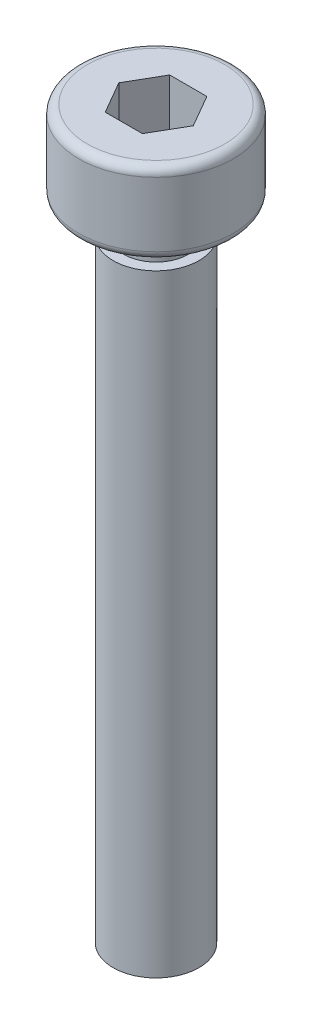
ISO-10303-21;
HEADER;
FILE_DESCRIPTION(('STEP AP214'),'2;1');
FILE_NAME('part.step','',(''),(''),'','','');
FILE_SCHEMA(('AUTOMOTIVE_DESIGN { 1 0 10303 214 1 1 1 1 }'));
ENDSEC;
DATA;
#1=APPLICATION_CONTEXT('core data for automotive mechanical design processes');
#2=APPLICATION_PROTOCOL_DEFINITION('international standard','automotive_design',2000,#1);
#3=PRODUCT_CONTEXT('',#1,'mechanical');
#4=PRODUCT('Part','Part','',(#3));
#5=PRODUCT_RELATED_PRODUCT_CATEGORY('part','',(#4));
#6=PRODUCT_DEFINITION_FORMATION('','',#4);
#7=PRODUCT_DEFINITION_CONTEXT('part definition',#1,'design');
#8=PRODUCT_DEFINITION('design','',#6,#7);
#9=PRODUCT_DEFINITION_SHAPE('','',#8);
#10=(LENGTH_UNIT() NAMED_UNIT(*) SI_UNIT(.MILLI.,.METRE.));
#11=(NAMED_UNIT(*) PLANE_ANGLE_UNIT() SI_UNIT($,.RADIAN.));
#12=(NAMED_UNIT(*) SI_UNIT($,.STERADIAN.) SOLID_ANGLE_UNIT());
#13=UNCERTAINTY_MEASURE_WITH_UNIT(LENGTH_MEASURE(1.E-05),#10,'distance_accuracy_value','');
#14=(GEOMETRIC_REPRESENTATION_CONTEXT(3) GLOBAL_UNCERTAINTY_ASSIGNED_CONTEXT((#13)) GLOBAL_UNIT_ASSIGNED_CONTEXT((#10,
#11,#12)) REPRESENTATION_CONTEXT('',''));
#15=CARTESIAN_POINT('',(0.,0.,0.));
#16=DIRECTION('',(0.,0.,1.));
#17=DIRECTION('',(1.,0.,0.));
#18=AXIS2_PLACEMENT_3D('',#15,#16,#17);
#19=CARTESIAN_POINT('',(0.,33.8,0.));
#20=DIRECTION('',(0.,-1.,0.));
#21=DIRECTION('',(0.,0.,-1.));
#22=AXIS2_PLACEMENT_3D('',#19,#20,#21);
#23=PLANE('',#22);
#24=DIRECTION('',(-0.5,0.,0.866025403784439));
#25=VECTOR('',#24,1.);
#26=CARTESIAN_POINT('',(-0.866025403784439,33.8,-1.5));
#27=LINE('',#26,#25);
#28=CARTESIAN_POINT('',(-0.866025403784439,33.8,-1.5));
#29=VERTEX_POINT('',#28);
#30=CARTESIAN_POINT('',(-1.73205080756888,33.8,0.));
#31=VERTEX_POINT('',#30);
#32=EDGE_CURVE('E124',#29,#31,#27,.T.);
#33=ORIENTED_EDGE('',*,*,#32,.F.);
#34=DIRECTION('',(-1.,0.,0.));
#35=VECTOR('',#34,1.);
#36=CARTESIAN_POINT('',(0.86602540378444,33.8,-1.5));
#37=LINE('',#36,#35);
#38=CARTESIAN_POINT('',(0.86602540378444,33.8,-1.5));
#39=VERTEX_POINT('',#38);
#40=EDGE_CURVE('E50',#39,#29,#37,.T.);
#41=ORIENTED_EDGE('',*,*,#40,.F.);
#42=DIRECTION('',(-0.5,0.,-0.866025403784439));
#43=VECTOR('',#42,1.);
#44=CARTESIAN_POINT('',(1.73205080756888,33.8,0.));
#45=LINE('',#44,#43);
#46=CARTESIAN_POINT('',(1.73205080756888,33.8,0.));
#47=VERTEX_POINT('',#46);
#48=EDGE_CURVE('E133',#47,#39,#45,.T.);
#49=ORIENTED_EDGE('',*,*,#48,.F.);
#50=DIRECTION('',(0.5,0.,-0.866025403784439));
#51=VECTOR('',#50,1.);
#52=CARTESIAN_POINT('',(0.866025403784438,33.8,1.5));
#53=LINE('',#52,#51);
#54=CARTESIAN_POINT('',(0.866025403784438,33.8,1.5));
#55=VERTEX_POINT('',#54);
#56=EDGE_CURVE('E131',#55,#47,#53,.T.);
#57=ORIENTED_EDGE('',*,*,#56,.F.);
#58=DIRECTION('',(1.,0.,0.));
#59=VECTOR('',#58,1.);
#60=CARTESIAN_POINT('',(-0.86602540378444,33.8,1.5));
#61=LINE('',#60,#59);
#62=CARTESIAN_POINT('',(-0.86602540378444,33.8,1.5));
#63=VERTEX_POINT('',#62);
#64=EDGE_CURVE('E98',#63,#55,#61,.T.);
#65=ORIENTED_EDGE('',*,*,#64,.F.);
#66=DIRECTION('',(0.5,0.,0.866025403784439));
#67=VECTOR('',#66,1.);
#68=CARTESIAN_POINT('',(-1.73205080756888,33.8,0.));
#69=LINE('',#68,#67);
#70=EDGE_CURVE('E127',#31,#63,#69,.T.);
#71=ORIENTED_EDGE('',*,*,#70,.F.);
#72=EDGE_LOOP('',(#33,#41,#49,#57,#65,#71));
#73=FACE_BOUND('',#72,.T.);
#74=CARTESIAN_POINT('',(0.,33.8,0.));
#75=DIRECTION('',(0.,-1.,0.));
#76=DIRECTION('',(0.,0.,-1.));
#77=AXIS2_PLACEMENT_3D('',#74,#75,#76);
#78=CIRCLE('',#77,3.2);
#79=CARTESIAN_POINT('',(0.,33.8,-3.2));
#80=VERTEX_POINT('',#79);
#81=EDGE_CURVE('E11',#80,#80,#78,.T.);
#82=ORIENTED_EDGE('',*,*,#81,.F.);
#83=EDGE_LOOP('',(#82));
#84=FACE_BOUND('',#83,.T.);
#85=ADVANCED_FACE('F36',(#73,#84),#23,.F.);
#86=CARTESIAN_POINT('',(0.,33.4,0.));
#87=DIRECTION('',(0.,-1.,0.));
#88=DIRECTION('',(0.,0.,-1.));
#89=AXIS2_PLACEMENT_3D('',#86,#87,#88);
#90=TOROIDAL_SURFACE('',#89,3.2,0.399999999999999);
#91=CARTESIAN_POINT('',(0.,33.4,0.));
#92=DIRECTION('',(0.,-1.,0.));
#93=DIRECTION('',(0.,0.,-1.));
#94=AXIS2_PLACEMENT_3D('',#91,#92,#93);
#95=CIRCLE('',#94,3.6);
#96=CARTESIAN_POINT('',(0.,33.4,-3.6));
#97=VERTEX_POINT('',#96);
#98=EDGE_CURVE('E43',#97,#97,#95,.T.);
#99=ORIENTED_EDGE('',*,*,#98,.F.);
#100=EDGE_LOOP('',(#99));
#101=FACE_BOUND('',#100,.T.);
#102=ORIENTED_EDGE('',*,*,#81,.T.);
#103=EDGE_LOOP('',(#102));
#104=FACE_BOUND('',#103,.T.);
#105=ADVANCED_FACE('F164',(#101,#104),#90,.T.);
#106=CARTESIAN_POINT('',(0.,0.,0.));
#107=DIRECTION('',(0.,-1.,0.));
#108=DIRECTION('',(0.,0.,-1.));
#109=AXIS2_PLACEMENT_3D('',#106,#107,#108);
#110=CYLINDRICAL_SURFACE('',#109,3.6);
#111=CARTESIAN_POINT('',(0.,30.4,0.));
#112=DIRECTION('',(0.,-1.,0.));
#113=DIRECTION('',(0.,0.,-1.));
#114=AXIS2_PLACEMENT_3D('',#111,#112,#113);
#115=CIRCLE('',#114,3.60000000000001);
#116=CARTESIAN_POINT('',(0.,30.4,-3.60000000000001));
#117=VERTEX_POINT('',#116);
#118=EDGE_CURVE('E157',#117,#117,#115,.T.);
#119=ORIENTED_EDGE('',*,*,#118,.F.);
#120=EDGE_LOOP('',(#119));
#121=FACE_BOUND('',#120,.T.);
#122=ORIENTED_EDGE('',*,*,#98,.T.);
#123=EDGE_LOOP('',(#122));
#124=FACE_BOUND('',#123,.T.);
#125=ADVANCED_FACE('F162',(#121,#124),#110,.T.);
#126=CARTESIAN_POINT('',(0.,30.4,0.));
#127=DIRECTION('',(0.,-1.,0.));
#128=DIRECTION('',(0.,0.,-1.));
#129=AXIS2_PLACEMENT_3D('',#126,#127,#128);
#130=TOROIDAL_SURFACE('',#129,3.2,0.400000000000004);
#131=CARTESIAN_POINT('',(0.,30.,0.));
#132=DIRECTION('',(0.,-1.,0.));
#133=DIRECTION('',(0.,0.,-1.));
#134=AXIS2_PLACEMENT_3D('',#131,#132,#133);
#135=CIRCLE('',#134,3.2);
#136=CARTESIAN_POINT('',(0.,30.,-3.2));
#137=VERTEX_POINT('',#136);
#138=EDGE_CURVE('E154',#137,#137,#135,.T.);
#139=ORIENTED_EDGE('',*,*,#138,.F.);
#140=EDGE_LOOP('',(#139));
#141=FACE_BOUND('',#140,.T.);
#142=ORIENTED_EDGE('',*,*,#118,.T.);
#143=EDGE_LOOP('',(#142));
#144=FACE_BOUND('',#143,.T.);
#145=ADVANCED_FACE('F209',(#141,#144),#130,.T.);
#146=CARTESIAN_POINT('',(-3.2,30.,0.));
#147=DIRECTION('',(0.,1.,0.));
#148=DIRECTION('',(0.,0.,1.));
#149=AXIS2_PLACEMENT_3D('',#146,#147,#148);
#150=PLANE('',#149);
#151=CARTESIAN_POINT('',(0.,30.,0.));
#152=DIRECTION('',(0.,-1.,0.));
#153=DIRECTION('',(0.,0.,-1.));
#154=AXIS2_PLACEMENT_3D('',#151,#152,#153);
#155=CIRCLE('',#154,1.5);
#156=CARTESIAN_POINT('',(0.,30.,-1.5));
#157=VERTEX_POINT('',#156);
#158=EDGE_CURVE('E151',#157,#157,#155,.T.);
#159=ORIENTED_EDGE('',*,*,#158,.F.);
#160=EDGE_LOOP('',(#159));
#161=FACE_BOUND('',#160,.T.);
#162=ORIENTED_EDGE('',*,*,#138,.T.);
#163=EDGE_LOOP('',(#162));
#164=FACE_BOUND('',#163,.T.);
#165=ADVANCED_FACE('F205',(#161,#164),#150,.F.);
#166=CARTESIAN_POINT('',(0.,0.,0.));
#167=DIRECTION('',(0.,-1.,0.));
#168=DIRECTION('',(0.,0.,-1.));
#169=AXIS2_PLACEMENT_3D('',#166,#167,#168);
#170=CYLINDRICAL_SURFACE('',#169,1.5);
#171=CARTESIAN_POINT('',(0.,28.5,0.));
#172=DIRECTION('',(0.,-1.,0.));
#173=DIRECTION('',(0.,0.,-1.));
#174=AXIS2_PLACEMENT_3D('',#171,#172,#173);
#175=CIRCLE('',#174,1.5);
#176=CARTESIAN_POINT('',(0.,28.5,-1.5));
#177=VERTEX_POINT('',#176);
#178=EDGE_CURVE('E148',#177,#177,#175,.T.);
#179=ORIENTED_EDGE('',*,*,#178,.F.);
#180=EDGE_LOOP('',(#179));
#181=FACE_BOUND('',#180,.T.);
#182=ORIENTED_EDGE('',*,*,#158,.T.);
#183=EDGE_LOOP('',(#182));
#184=FACE_BOUND('',#183,.T.);
#185=ADVANCED_FACE('F201',(#181,#184),#170,.T.);
#186=CARTESIAN_POINT('',(-1.5,28.5,0.));
#187=DIRECTION('',(0.,-1.,0.));
#188=DIRECTION('',(0.,0.,-1.));
#189=AXIS2_PLACEMENT_3D('',#186,#187,#188);
#190=PLANE('',#189);
#191=CARTESIAN_POINT('',(0.,28.5,0.));
#192=DIRECTION('',(0.,-1.,0.));
#193=DIRECTION('',(0.,0.,-1.));
#194=AXIS2_PLACEMENT_3D('',#191,#192,#193);
#195=CIRCLE('',#194,2.);
#196=CARTESIAN_POINT('',(0.,28.5,-2.));
#197=VERTEX_POINT('',#196);
#198=EDGE_CURVE('E145',#197,#197,#195,.T.);
#199=ORIENTED_EDGE('',*,*,#198,.F.);
#200=EDGE_LOOP('',(#199));
#201=FACE_BOUND('',#200,.T.);
#202=ORIENTED_EDGE('',*,*,#178,.T.);
#203=EDGE_LOOP('',(#202));
#204=FACE_BOUND('',#203,.T.);
#205=ADVANCED_FACE('F197',(#201,#204),#190,.F.);
#206=CARTESIAN_POINT('',(0.,0.,0.));
#207=DIRECTION('',(0.,-1.,0.));
#208=DIRECTION('',(0.,0.,-1.));
#209=AXIS2_PLACEMENT_3D('',#206,#207,#208);
#210=CYLINDRICAL_SURFACE('',#209,2.);
#211=CARTESIAN_POINT('',(0.,0.,0.));
#212=DIRECTION('',(0.,-1.,0.));
#213=DIRECTION('',(0.,0.,-1.));
#214=AXIS2_PLACEMENT_3D('',#211,#212,#213);
#215=CIRCLE('',#214,2.);
#216=CARTESIAN_POINT('',(0.,0.,-2.));
#217=VERTEX_POINT('',#216);
#218=EDGE_CURVE('E137',#217,#217,#215,.T.);
#219=ORIENTED_EDGE('',*,*,#218,.F.);
#220=EDGE_LOOP('',(#219));
#221=FACE_BOUND('',#220,.T.);
#222=ORIENTED_EDGE('',*,*,#198,.T.);
#223=EDGE_LOOP('',(#222));
#224=FACE_BOUND('',#223,.T.);
#225=ADVANCED_FACE('F189',(#221,#224),#210,.T.);
#226=CARTESIAN_POINT('',(-2.,0.,0.));
#227=DIRECTION('',(0.,1.,0.));
#228=DIRECTION('',(0.,0.,1.));
#229=AXIS2_PLACEMENT_3D('',#226,#227,#228);
#230=PLANE('',#229);
#231=ORIENTED_EDGE('',*,*,#218,.T.);
#232=EDGE_LOOP('',(#231));
#233=FACE_BOUND('',#232,.T.);
#234=ADVANCED_FACE('F182',(#233),#230,.F.);
#235=CARTESIAN_POINT('',(0.86602540378444,31.,-1.5));
#236=DIRECTION('',(0.,0.,-1.));
#237=DIRECTION('',(-1.,0.,0.));
#238=AXIS2_PLACEMENT_3D('',#235,#236,#237);
#239=PLANE('',#238);
#240=ORIENTED_EDGE('',*,*,#40,.T.);
#241=DIRECTION('',(0.,1.,0.));
#242=VECTOR('',#241,1.);
#243=CARTESIAN_POINT('',(-0.866025403784439,31.,-1.5));
#244=LINE('',#243,#242);
#245=CARTESIAN_POINT('',(-0.866025403784439,31.,-1.5));
#246=VERTEX_POINT('',#245);
#247=EDGE_CURVE('E80',#246,#29,#244,.T.);
#248=ORIENTED_EDGE('',*,*,#247,.F.);
#249=DIRECTION('',(-1.,0.,0.));
#250=VECTOR('',#249,1.);
#251=CARTESIAN_POINT('',(0.86602540378444,31.,-1.5));
#252=LINE('',#251,#250);
#253=CARTESIAN_POINT('',(0.86602540378444,31.,-1.5));
#254=VERTEX_POINT('',#253);
#255=EDGE_CURVE('E135',#254,#246,#252,.T.);
#256=ORIENTED_EDGE('',*,*,#255,.F.);
#257=DIRECTION('',(0.,1.,0.));
#258=VECTOR('',#257,1.);
#259=CARTESIAN_POINT('',(0.86602540378444,31.,-1.5));
#260=LINE('',#259,#258);
#261=EDGE_CURVE('E58',#254,#39,#260,.T.);
#262=ORIENTED_EDGE('',*,*,#261,.T.);
#263=EDGE_LOOP('',(#240,#248,#256,#262));
#264=FACE_BOUND('',#263,.T.);
#265=ADVANCED_FACE('F179',(#264),#239,.F.);
#266=CARTESIAN_POINT('',(1.73205080756888,31.,0.));
#267=DIRECTION('',(0.866025403784439,0.,-0.5));
#268=DIRECTION('',(-0.5,0.,-0.866025403784439));
#269=AXIS2_PLACEMENT_3D('',#266,#267,#268);
#270=PLANE('',#269);
#271=ORIENTED_EDGE('',*,*,#48,.T.);
#272=ORIENTED_EDGE('',*,*,#261,.F.);
#273=DIRECTION('',(-0.5,0.,-0.866025403784439));
#274=VECTOR('',#273,1.);
#275=CARTESIAN_POINT('',(1.73205080756888,31.,0.));
#276=LINE('',#275,#274);
#277=CARTESIAN_POINT('',(1.73205080756888,31.,0.));
#278=VERTEX_POINT('',#277);
#279=EDGE_CURVE('E110',#278,#254,#276,.T.);
#280=ORIENTED_EDGE('',*,*,#279,.F.);
#281=DIRECTION('',(0.,1.,0.));
#282=VECTOR('',#281,1.);
#283=CARTESIAN_POINT('',(1.73205080756888,31.,0.));
#284=LINE('',#283,#282);
#285=EDGE_CURVE('E102',#278,#47,#284,.T.);
#286=ORIENTED_EDGE('',*,*,#285,.T.);
#287=EDGE_LOOP('',(#271,#272,#280,#286));
#288=FACE_BOUND('',#287,.T.);
#289=ADVANCED_FACE('F181',(#288),#270,.F.);
#290=CARTESIAN_POINT('',(0.866025403784438,31.,1.5));
#291=DIRECTION('',(0.866025403784439,0.,0.5));
#292=DIRECTION('',(0.5,0.,-0.866025403784438));
#293=AXIS2_PLACEMENT_3D('',#290,#291,#292);
#294=PLANE('',#293);
#295=ORIENTED_EDGE('',*,*,#56,.T.);
#296=ORIENTED_EDGE('',*,*,#285,.F.);
#297=DIRECTION('',(0.5,0.,-0.866025403784439));
#298=VECTOR('',#297,1.);
#299=CARTESIAN_POINT('',(0.866025403784438,31.,1.5));
#300=LINE('',#299,#298);
#301=CARTESIAN_POINT('',(0.866025403784438,31.,1.5));
#302=VERTEX_POINT('',#301);
#303=EDGE_CURVE('E106',#302,#278,#300,.T.);
#304=ORIENTED_EDGE('',*,*,#303,.F.);
#305=DIRECTION('',(0.,1.,0.));
#306=VECTOR('',#305,1.);
#307=CARTESIAN_POINT('',(0.866025403784438,31.,1.5));
#308=LINE('',#307,#306);
#309=EDGE_CURVE('E91',#302,#55,#308,.T.);
#310=ORIENTED_EDGE('',*,*,#309,.T.);
#311=EDGE_LOOP('',(#295,#296,#304,#310));
#312=FACE_BOUND('',#311,.T.);
#313=ADVANCED_FACE('F107',(#312),#294,.F.);
#314=CARTESIAN_POINT('',(-0.86602540378444,31.,1.5));
#315=DIRECTION('',(0.,0.,1.));
#316=DIRECTION('',(1.,0.,0.));
#317=AXIS2_PLACEMENT_3D('',#314,#315,#316);
#318=PLANE('',#317);
#319=ORIENTED_EDGE('',*,*,#64,.T.);
#320=ORIENTED_EDGE('',*,*,#309,.F.);
#321=DIRECTION('',(1.,0.,0.));
#322=VECTOR('',#321,1.);
#323=CARTESIAN_POINT('',(-0.86602540378444,31.,1.5));
#324=LINE('',#323,#322);
#325=CARTESIAN_POINT('',(-0.86602540378444,31.,1.5));
#326=VERTEX_POINT('',#325);
#327=EDGE_CURVE('E95',#326,#302,#324,.T.);
#328=ORIENTED_EDGE('',*,*,#327,.F.);
#329=DIRECTION('',(0.,1.,0.));
#330=VECTOR('',#329,1.);
#331=CARTESIAN_POINT('',(-0.86602540378444,31.,1.5));
#332=LINE('',#331,#330);
#333=EDGE_CURVE('E103',#326,#63,#332,.T.);
#334=ORIENTED_EDGE('',*,*,#333,.T.);
#335=EDGE_LOOP('',(#319,#320,#328,#334));
#336=FACE_BOUND('',#335,.T.);
#337=ADVANCED_FACE('F93',(#336),#318,.F.);
#338=CARTESIAN_POINT('',(-1.73205080756888,31.,0.));
#339=DIRECTION('',(-0.866025403784439,0.,0.5));
#340=DIRECTION('',(0.5,0.,0.866025403784439));
#341=AXIS2_PLACEMENT_3D('',#338,#339,#340);
#342=PLANE('',#341);
#343=ORIENTED_EDGE('',*,*,#70,.T.);
#344=ORIENTED_EDGE('',*,*,#333,.F.);
#345=DIRECTION('',(0.5,0.,0.866025403784439));
#346=VECTOR('',#345,1.);
#347=CARTESIAN_POINT('',(-1.73205080756888,31.,0.));
#348=LINE('',#347,#346);
#349=CARTESIAN_POINT('',(-1.73205080756888,31.,0.));
#350=VERTEX_POINT('',#349);
#351=EDGE_CURVE('E116',#350,#326,#348,.T.);
#352=ORIENTED_EDGE('',*,*,#351,.F.);
#353=DIRECTION('',(0.,1.,0.));
#354=VECTOR('',#353,1.);
#355=CARTESIAN_POINT('',(-1.73205080756888,31.,0.));
#356=LINE('',#355,#354);
#357=EDGE_CURVE('E140',#350,#31,#356,.T.);
#358=ORIENTED_EDGE('',*,*,#357,.T.);
#359=EDGE_LOOP('',(#343,#344,#352,#358));
#360=FACE_BOUND('',#359,.T.);
#361=ADVANCED_FACE('F280',(#360),#342,.F.);
#362=CARTESIAN_POINT('',(-0.866025403784439,31.,-1.5));
#363=DIRECTION('',(-0.866025403784439,0.,-0.5));
#364=DIRECTION('',(-0.5,0.,0.866025403784439));
#365=AXIS2_PLACEMENT_3D('',#362,#363,#364);
#366=PLANE('',#365);
#367=ORIENTED_EDGE('',*,*,#32,.T.);
#368=ORIENTED_EDGE('',*,*,#357,.F.);
#369=DIRECTION('',(-0.5,0.,0.866025403784439));
#370=VECTOR('',#369,1.);
#371=CARTESIAN_POINT('',(-0.866025403784439,31.,-1.5));
#372=LINE('',#371,#370);
#373=EDGE_CURVE('E118',#246,#350,#372,.T.);
#374=ORIENTED_EDGE('',*,*,#373,.F.);
#375=ORIENTED_EDGE('',*,*,#247,.T.);
#376=EDGE_LOOP('',(#367,#368,#374,#375));
#377=FACE_BOUND('',#376,.T.);
#378=ADVANCED_FACE('F177',(#377),#366,.F.);
#379=CARTESIAN_POINT('',(0.,31.,0.));
#380=DIRECTION('',(0.,1.,0.));
#381=DIRECTION('',(0.,0.,1.));
#382=AXIS2_PLACEMENT_3D('',#379,#380,#381);
#383=PLANE('',#382);
#384=ORIENTED_EDGE('',*,*,#255,.T.);
#385=ORIENTED_EDGE('',*,*,#373,.T.);
#386=ORIENTED_EDGE('',*,*,#351,.T.);
#387=ORIENTED_EDGE('',*,*,#327,.T.);
#388=ORIENTED_EDGE('',*,*,#303,.T.);
#389=ORIENTED_EDGE('',*,*,#279,.T.);
#390=EDGE_LOOP('',(#384,#385,#386,#387,#388,#389));
#391=FACE_BOUND('',#390,.T.);
#392=ADVANCED_FACE('F113',(#391),#383,.T.);
#393=CLOSED_SHELL('',(#85,#105,#125,#145,#165,#185,#205,#225,#234,#265,#289,#313,#337,#361,#378,#392));
#394=MANIFOLD_SOLID_BREP('B2',#393);
#395=ADVANCED_BREP_SHAPE_REPRESENTATION('',(#18,#394),#14);
#396=SHAPE_DEFINITION_REPRESENTATION(#9,#395);
ENDSEC;
END-ISO-10303-21;
